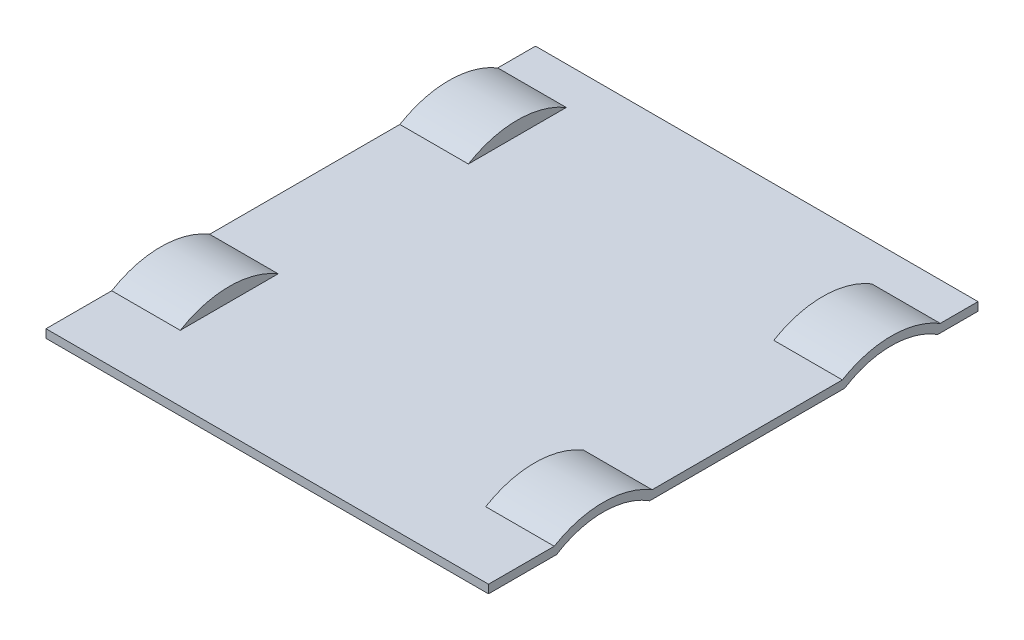
ISO-10303-21;
HEADER;
FILE_DESCRIPTION(('STEP AP214'),'2;1');
FILE_NAME('part.step','',(''),(''),'','','');
FILE_SCHEMA(('AUTOMOTIVE_DESIGN { 1 0 10303 214 1 1 1 1 }'));
ENDSEC;
DATA;
#1=APPLICATION_CONTEXT('core data for automotive mechanical design processes');
#2=APPLICATION_PROTOCOL_DEFINITION('international standard','automotive_design',2000,#1);
#3=PRODUCT_CONTEXT('',#1,'mechanical');
#4=PRODUCT('Part','Part','',(#3));
#5=PRODUCT_RELATED_PRODUCT_CATEGORY('part','',(#4));
#6=PRODUCT_DEFINITION_FORMATION('','',#4);
#7=PRODUCT_DEFINITION_CONTEXT('part definition',#1,'design');
#8=PRODUCT_DEFINITION('design','',#6,#7);
#9=PRODUCT_DEFINITION_SHAPE('','',#8);
#10=(LENGTH_UNIT() NAMED_UNIT(*) SI_UNIT(.MILLI.,.METRE.));
#11=(NAMED_UNIT(*) PLANE_ANGLE_UNIT() SI_UNIT($,.RADIAN.));
#12=(NAMED_UNIT(*) SI_UNIT($,.STERADIAN.) SOLID_ANGLE_UNIT());
#13=UNCERTAINTY_MEASURE_WITH_UNIT(LENGTH_MEASURE(1.E-05),#10,'distance_accuracy_value','');
#14=(GEOMETRIC_REPRESENTATION_CONTEXT(3) GLOBAL_UNCERTAINTY_ASSIGNED_CONTEXT((#13)) GLOBAL_UNIT_ASSIGNED_CONTEXT((#10,
#11,#12)) REPRESENTATION_CONTEXT('',''));
#15=CARTESIAN_POINT('',(0.,0.,0.));
#16=DIRECTION('',(0.,0.,1.));
#17=DIRECTION('',(1.,0.,0.));
#18=AXIS2_PLACEMENT_3D('',#15,#16,#17);
#19=CARTESIAN_POINT('',(-158.2,0.,0.));
#20=DIRECTION('',(0.,-1.,0.));
#21=DIRECTION('',(0.,0.,-1.));
#22=AXIS2_PLACEMENT_3D('',#19,#20,#21);
#23=PLANE('',#22);
#24=DIRECTION('',(0.,0.,-1.));
#25=VECTOR('',#24,1.);
#26=CARTESIAN_POINT('',(-158.2,0.,0.));
#27=LINE('',#26,#25);
#28=CARTESIAN_POINT('',(-158.2,0.,0.));
#29=VERTEX_POINT('',#28);
#30=CARTESIAN_POINT('',(-158.2,0.,-24.3513514061952));
#31=VERTEX_POINT('',#30);
#32=EDGE_CURVE('E183',#29,#31,#27,.T.);
#33=ORIENTED_EDGE('',*,*,#32,.T.);
#34=DIRECTION('',(-1.,0.,0.));
#35=VECTOR('',#34,1.);
#36=CARTESIAN_POINT('',(-136.2,0.,-24.3513514061952));
#37=LINE('',#36,#35);
#38=CARTESIAN_POINT('',(-136.2,0.,-24.3513514061952));
#39=VERTEX_POINT('',#38);
#40=EDGE_CURVE('E57',#39,#31,#37,.T.);
#41=ORIENTED_EDGE('',*,*,#40,.F.);
#42=DIRECTION('',(0.,0.,-1.));
#43=VECTOR('',#42,1.);
#44=CARTESIAN_POINT('',(-136.2,0.,0.));
#45=LINE('',#44,#43);
#46=CARTESIAN_POINT('',(-136.2,0.,-57.6486485938048));
#47=VERTEX_POINT('',#46);
#48=EDGE_CURVE('E175',#39,#47,#45,.T.);
#49=ORIENTED_EDGE('',*,*,#48,.T.);
#50=DIRECTION('',(-1.,0.,0.));
#51=VECTOR('',#50,1.);
#52=CARTESIAN_POINT('',(-136.2,0.,-57.6486485938048));
#53=LINE('',#52,#51);
#54=CARTESIAN_POINT('',(-158.2,0.,-57.6486485938048));
#55=VERTEX_POINT('',#54);
#56=EDGE_CURVE('E172',#47,#55,#53,.T.);
#57=ORIENTED_EDGE('',*,*,#56,.T.);
#58=CARTESIAN_POINT('',(-158.2,0.,-127.351351406195));
#59=VERTEX_POINT('',#58);
#60=EDGE_CURVE('E280',#55,#59,#27,.T.);
#61=ORIENTED_EDGE('',*,*,#60,.T.);
#62=DIRECTION('',(-1.,0.,0.));
#63=VECTOR('',#62,1.);
#64=CARTESIAN_POINT('',(-136.2,0.,-127.351351406195));
#65=LINE('',#64,#63);
#66=CARTESIAN_POINT('',(-136.2,0.,-127.351351406195));
#67=VERTEX_POINT('',#66);
#68=EDGE_CURVE('E49',#67,#59,#65,.T.);
#69=ORIENTED_EDGE('',*,*,#68,.F.);
#70=DIRECTION('',(0.,0.,-1.));
#71=VECTOR('',#70,1.);
#72=CARTESIAN_POINT('',(-136.2,0.,0.));
#73=LINE('',#72,#71);
#74=CARTESIAN_POINT('',(-136.2,0.,-160.648648593805));
#75=VERTEX_POINT('',#74);
#76=EDGE_CURVE('E189',#67,#75,#73,.T.);
#77=ORIENTED_EDGE('',*,*,#76,.T.);
#78=DIRECTION('',(-1.,0.,0.));
#79=VECTOR('',#78,1.);
#80=CARTESIAN_POINT('',(-136.2,0.,-160.648648593805));
#81=LINE('',#80,#79);
#82=CARTESIAN_POINT('',(-158.2,0.,-160.648648593805));
#83=VERTEX_POINT('',#82);
#84=EDGE_CURVE('E196',#75,#83,#81,.T.);
#85=ORIENTED_EDGE('',*,*,#84,.T.);
#86=CARTESIAN_POINT('',(-158.2,0.,-175.));
#87=VERTEX_POINT('',#86);
#88=EDGE_CURVE('E281',#83,#87,#27,.T.);
#89=ORIENTED_EDGE('',*,*,#88,.T.);
#90=DIRECTION('',(1.,0.,0.));
#91=VECTOR('',#90,1.);
#92=CARTESIAN_POINT('',(-158.2,0.,-175.));
#93=LINE('',#92,#91);
#94=CARTESIAN_POINT('',(0.,0.,-175.));
#95=VERTEX_POINT('',#94);
#96=EDGE_CURVE('E36',#87,#95,#93,.T.);
#97=ORIENTED_EDGE('',*,*,#96,.T.);
#98=DIRECTION('',(0.,0.,-1.));
#99=VECTOR('',#98,1.);
#100=CARTESIAN_POINT('',(0.,0.,0.));
#101=LINE('',#100,#99);
#102=CARTESIAN_POINT('',(0.,0.,-160.648648593805));
#103=VERTEX_POINT('',#102);
#104=EDGE_CURVE('E275',#103,#95,#101,.T.);
#105=ORIENTED_EDGE('',*,*,#104,.F.);
#106=DIRECTION('',(1.,0.,0.));
#107=VECTOR('',#106,1.);
#108=CARTESIAN_POINT('',(-22.,0.,-160.648648593805));
#109=LINE('',#108,#107);
#110=CARTESIAN_POINT('',(-22.,0.,-160.648648593805));
#111=VERTEX_POINT('',#110);
#112=EDGE_CURVE('E247',#111,#103,#109,.T.);
#113=ORIENTED_EDGE('',*,*,#112,.F.);
#114=DIRECTION('',(0.,0.,-1.));
#115=VECTOR('',#114,1.);
#116=CARTESIAN_POINT('',(-22.,0.,0.));
#117=LINE('',#116,#115);
#118=CARTESIAN_POINT('',(-22.,0.,-127.351351406195));
#119=VERTEX_POINT('',#118);
#120=EDGE_CURVE('E242',#119,#111,#117,.T.);
#121=ORIENTED_EDGE('',*,*,#120,.F.);
#122=DIRECTION('',(1.,0.,0.));
#123=VECTOR('',#122,1.);
#124=CARTESIAN_POINT('',(-22.,0.,-127.351351406195));
#125=LINE('',#124,#123);
#126=CARTESIAN_POINT('',(0.,0.,-127.351351406195));
#127=VERTEX_POINT('',#126);
#128=EDGE_CURVE('E236',#119,#127,#125,.T.);
#129=ORIENTED_EDGE('',*,*,#128,.T.);
#130=CARTESIAN_POINT('',(0.,0.,-57.6486485938048));
#131=VERTEX_POINT('',#130);
#132=EDGE_CURVE('E295',#131,#127,#101,.T.);
#133=ORIENTED_EDGE('',*,*,#132,.F.);
#134=DIRECTION('',(1.,0.,0.));
#135=VECTOR('',#134,1.);
#136=CARTESIAN_POINT('',(-22.,0.,-57.6486485938048));
#137=LINE('',#136,#135);
#138=CARTESIAN_POINT('',(-22.,0.,-57.6486485938048));
#139=VERTEX_POINT('',#138);
#140=EDGE_CURVE('E234',#139,#131,#137,.T.);
#141=ORIENTED_EDGE('',*,*,#140,.F.);
#142=DIRECTION('',(0.,0.,-1.));
#143=VECTOR('',#142,1.);
#144=CARTESIAN_POINT('',(-22.,0.,0.));
#145=LINE('',#144,#143);
#146=CARTESIAN_POINT('',(-22.,0.,-24.3513514061952));
#147=VERTEX_POINT('',#146);
#148=EDGE_CURVE('E228',#147,#139,#145,.T.);
#149=ORIENTED_EDGE('',*,*,#148,.F.);
#150=DIRECTION('',(1.,0.,0.));
#151=VECTOR('',#150,1.);
#152=CARTESIAN_POINT('',(-22.,0.,-24.3513514061952));
#153=LINE('',#152,#151);
#154=CARTESIAN_POINT('',(0.,0.,-24.3513514061952));
#155=VERTEX_POINT('',#154);
#156=EDGE_CURVE('E237',#147,#155,#153,.T.);
#157=ORIENTED_EDGE('',*,*,#156,.T.);
#158=CARTESIAN_POINT('',(0.,0.,0.));
#159=VERTEX_POINT('',#158);
#160=EDGE_CURVE('E291',#159,#155,#101,.T.);
#161=ORIENTED_EDGE('',*,*,#160,.F.);
#162=DIRECTION('',(1.,0.,0.));
#163=VECTOR('',#162,1.);
#164=CARTESIAN_POINT('',(-158.2,0.,0.));
#165=LINE('',#164,#163);
#166=EDGE_CURVE('E11',#29,#159,#165,.T.);
#167=ORIENTED_EDGE('',*,*,#166,.F.);
#168=EDGE_LOOP('',(#33,#41,#49,#57,#61,#69,#77,#85,#89,#97,#105,#113,#121,#129,#133,#141,#149,
#157,#161,#167));
#169=FACE_BOUND('',#168,.T.);
#170=ADVANCED_FACE('F33',(#169),#23,.T.);
#171=CARTESIAN_POINT('',(-158.2,2.99999999999998,0.));
#172=DIRECTION('',(0.,1.,0.));
#173=DIRECTION('',(0.,0.,1.));
#174=AXIS2_PLACEMENT_3D('',#171,#172,#173);
#175=PLANE('',#174);
#176=DIRECTION('',(0.,0.,1.));
#177=VECTOR('',#176,1.);
#178=CARTESIAN_POINT('',(-158.2,2.99999999999998,0.));
#179=LINE('',#178,#177);
#180=CARTESIAN_POINT('',(-158.2,3.,-175.));
#181=VERTEX_POINT('',#180);
#182=CARTESIAN_POINT('',(-158.2,3.,-161.500785696648));
#183=VERTEX_POINT('',#182);
#184=EDGE_CURVE('E285',#181,#183,#179,.T.);
#185=ORIENTED_EDGE('',*,*,#184,.T.);
#186=DIRECTION('',(-1.,0.,0.));
#187=VECTOR('',#186,1.);
#188=CARTESIAN_POINT('',(-133.7,3.,-161.500785696648));
#189=LINE('',#188,#187);
#190=CARTESIAN_POINT('',(-133.7,3.,-161.500785696648));
#191=VERTEX_POINT('',#190);
#192=EDGE_CURVE('E208',#191,#183,#189,.T.);
#193=ORIENTED_EDGE('',*,*,#192,.F.);
#194=DIRECTION('',(0.,0.,1.));
#195=VECTOR('',#194,1.);
#196=CARTESIAN_POINT('',(-133.7,2.99999999999998,0.));
#197=LINE('',#196,#195);
#198=CARTESIAN_POINT('',(-133.7,2.99999999999999,-126.499214303352));
#199=VERTEX_POINT('',#198);
#200=EDGE_CURVE('E200',#191,#199,#197,.T.);
#201=ORIENTED_EDGE('',*,*,#200,.T.);
#202=DIRECTION('',(-1.,0.,0.));
#203=VECTOR('',#202,1.);
#204=CARTESIAN_POINT('',(-133.7,2.99999999999999,-126.499214303352));
#205=LINE('',#204,#203);
#206=CARTESIAN_POINT('',(-158.2,2.99999999999999,-126.499214303352));
#207=VERTEX_POINT('',#206);
#208=EDGE_CURVE('E205',#199,#207,#205,.T.);
#209=ORIENTED_EDGE('',*,*,#208,.T.);
#210=CARTESIAN_POINT('',(-158.2,2.99999999999998,-58.5007856966481));
#211=VERTEX_POINT('',#210);
#212=EDGE_CURVE('E288',#207,#211,#179,.T.);
#213=ORIENTED_EDGE('',*,*,#212,.T.);
#214=DIRECTION('',(-1.,0.,0.));
#215=VECTOR('',#214,1.);
#216=CARTESIAN_POINT('',(-133.7,2.99999999999998,-58.5007856966481));
#217=LINE('',#216,#215);
#218=CARTESIAN_POINT('',(-133.7,2.99999999999999,-58.5007856966481));
#219=VERTEX_POINT('',#218);
#220=EDGE_CURVE('E222',#219,#211,#217,.T.);
#221=ORIENTED_EDGE('',*,*,#220,.F.);
#222=DIRECTION('',(0.,0.,1.));
#223=VECTOR('',#222,1.);
#224=CARTESIAN_POINT('',(-133.7,2.99999999999998,0.));
#225=LINE('',#224,#223);
#226=CARTESIAN_POINT('',(-133.7,2.99999999999998,-23.4992143033519));
#227=VERTEX_POINT('',#226);
#228=EDGE_CURVE('E214',#219,#227,#225,.T.);
#229=ORIENTED_EDGE('',*,*,#228,.T.);
#230=DIRECTION('',(-1.,0.,0.));
#231=VECTOR('',#230,1.);
#232=CARTESIAN_POINT('',(-133.7,2.99999999999998,-23.4992143033519));
#233=LINE('',#232,#231);
#234=CARTESIAN_POINT('',(-158.2,2.99999999999998,-23.4992143033519));
#235=VERTEX_POINT('',#234);
#236=EDGE_CURVE('E219',#227,#235,#233,.T.);
#237=ORIENTED_EDGE('',*,*,#236,.T.);
#238=CARTESIAN_POINT('',(-158.2,2.99999999999998,0.));
#239=VERTEX_POINT('',#238);
#240=EDGE_CURVE('E284',#235,#239,#179,.T.);
#241=ORIENTED_EDGE('',*,*,#240,.T.);
#242=DIRECTION('',(1.,0.,0.));
#243=VECTOR('',#242,1.);
#244=CARTESIAN_POINT('',(-158.2,2.99999999999998,0.));
#245=LINE('',#244,#243);
#246=CARTESIAN_POINT('',(0.,2.99999999999998,0.));
#247=VERTEX_POINT('',#246);
#248=EDGE_CURVE('E41',#239,#247,#245,.T.);
#249=ORIENTED_EDGE('',*,*,#248,.T.);
#250=DIRECTION('',(0.,0.,1.));
#251=VECTOR('',#250,1.);
#252=CARTESIAN_POINT('',(0.,2.99999999999998,0.));
#253=LINE('',#252,#251);
#254=CARTESIAN_POINT('',(0.,2.99999999999998,-23.4992143033519));
#255=VERTEX_POINT('',#254);
#256=EDGE_CURVE('E298',#255,#247,#253,.T.);
#257=ORIENTED_EDGE('',*,*,#256,.F.);
#258=DIRECTION('',(1.,0.,0.));
#259=VECTOR('',#258,1.);
#260=CARTESIAN_POINT('',(-24.5,2.99999999999998,-23.4992143033519));
#261=LINE('',#260,#259);
#262=CARTESIAN_POINT('',(-24.5,2.99999999999998,-23.4992143033519));
#263=VERTEX_POINT('',#262);
#264=EDGE_CURVE('E272',#263,#255,#261,.T.);
#265=ORIENTED_EDGE('',*,*,#264,.F.);
#266=DIRECTION('',(0.,0.,1.));
#267=VECTOR('',#266,1.);
#268=CARTESIAN_POINT('',(-24.5,2.99999999999998,0.));
#269=LINE('',#268,#267);
#270=CARTESIAN_POINT('',(-24.5,2.99999999999998,-58.5007856966481));
#271=VERTEX_POINT('',#270);
#272=EDGE_CURVE('E265',#271,#263,#269,.T.);
#273=ORIENTED_EDGE('',*,*,#272,.F.);
#274=DIRECTION('',(1.,0.,0.));
#275=VECTOR('',#274,1.);
#276=CARTESIAN_POINT('',(-24.5,2.99999999999998,-58.5007856966481));
#277=LINE('',#276,#275);
#278=CARTESIAN_POINT('',(0.,2.99999999999998,-58.5007856966481));
#279=VERTEX_POINT('',#278);
#280=EDGE_CURVE('E270',#271,#279,#277,.T.);
#281=ORIENTED_EDGE('',*,*,#280,.T.);
#282=CARTESIAN_POINT('',(0.,2.99999999999999,-126.499214303352));
#283=VERTEX_POINT('',#282);
#284=EDGE_CURVE('E303',#283,#279,#253,.T.);
#285=ORIENTED_EDGE('',*,*,#284,.F.);
#286=DIRECTION('',(1.,0.,0.));
#287=VECTOR('',#286,1.);
#288=CARTESIAN_POINT('',(-24.5,2.99999999999999,-126.499214303352));
#289=LINE('',#288,#287);
#290=CARTESIAN_POINT('',(-24.5,2.99999999999999,-126.499214303352));
#291=VERTEX_POINT('',#290);
#292=EDGE_CURVE('E259',#291,#283,#289,.T.);
#293=ORIENTED_EDGE('',*,*,#292,.F.);
#294=DIRECTION('',(0.,0.,1.));
#295=VECTOR('',#294,1.);
#296=CARTESIAN_POINT('',(-24.5,2.99999999999998,0.));
#297=LINE('',#296,#295);
#298=CARTESIAN_POINT('',(-24.5,3.,-161.500785696648));
#299=VERTEX_POINT('',#298);
#300=EDGE_CURVE('E252',#299,#291,#297,.T.);
#301=ORIENTED_EDGE('',*,*,#300,.F.);
#302=DIRECTION('',(1.,0.,0.));
#303=VECTOR('',#302,1.);
#304=CARTESIAN_POINT('',(-24.5,3.,-161.500785696648));
#305=LINE('',#304,#303);
#306=CARTESIAN_POINT('',(0.,3.,-161.500785696648));
#307=VERTEX_POINT('',#306);
#308=EDGE_CURVE('E257',#299,#307,#305,.T.);
#309=ORIENTED_EDGE('',*,*,#308,.T.);
#310=CARTESIAN_POINT('',(0.,3.,-175.));
#311=VERTEX_POINT('',#310);
#312=EDGE_CURVE('E299',#311,#307,#253,.T.);
#313=ORIENTED_EDGE('',*,*,#312,.F.);
#314=DIRECTION('',(1.,0.,0.));
#315=VECTOR('',#314,1.);
#316=CARTESIAN_POINT('',(-158.2,3.,-175.));
#317=LINE('',#316,#315);
#318=EDGE_CURVE('E307',#181,#311,#317,.T.);
#319=ORIENTED_EDGE('',*,*,#318,.F.);
#320=EDGE_LOOP('',(#185,#193,#201,#209,#213,#221,#229,#237,#241,#249,#257,#265,#273,#281,#285,
#293,#301,#309,#313,#319));
#321=FACE_BOUND('',#320,.T.);
#322=ADVANCED_FACE('F345',(#321),#175,.T.);
#323=CARTESIAN_POINT('',(-158.2,0.,0.));
#324=DIRECTION('',(0.,0.,1.));
#325=DIRECTION('',(0.,-1.,0.));
#326=AXIS2_PLACEMENT_3D('',#323,#324,#325);
#327=PLANE('',#326);
#328=DIRECTION('',(0.,-1.,0.));
#329=VECTOR('',#328,1.);
#330=CARTESIAN_POINT('',(0.,0.,0.));
#331=LINE('',#330,#329);
#332=EDGE_CURVE('E302',#247,#159,#331,.T.);
#333=ORIENTED_EDGE('',*,*,#332,.F.);
#334=ORIENTED_EDGE('',*,*,#248,.F.);
#335=DIRECTION('',(0.,-1.,0.));
#336=VECTOR('',#335,1.);
#337=CARTESIAN_POINT('',(-158.2,0.,0.));
#338=LINE('',#337,#336);
#339=EDGE_CURVE('E287',#239,#29,#338,.T.);
#340=ORIENTED_EDGE('',*,*,#339,.T.);
#341=ORIENTED_EDGE('',*,*,#166,.T.);
#342=EDGE_LOOP('',(#333,#334,#340,#341));
#343=FACE_BOUND('',#342,.T.);
#344=ADVANCED_FACE('F349',(#343),#327,.T.);
#345=CARTESIAN_POINT('',(-158.2,0.,-175.));
#346=DIRECTION('',(0.,0.,-1.));
#347=DIRECTION('',(-1.,0.,0.));
#348=AXIS2_PLACEMENT_3D('',#345,#346,#347);
#349=PLANE('',#348);
#350=DIRECTION('',(0.,1.,0.));
#351=VECTOR('',#350,1.);
#352=CARTESIAN_POINT('',(0.,0.,-175.));
#353=LINE('',#352,#351);
#354=EDGE_CURVE('E294',#95,#311,#353,.T.);
#355=ORIENTED_EDGE('',*,*,#354,.F.);
#356=ORIENTED_EDGE('',*,*,#96,.F.);
#357=DIRECTION('',(0.,1.,0.));
#358=VECTOR('',#357,1.);
#359=CARTESIAN_POINT('',(-158.2,0.,-175.));
#360=LINE('',#359,#358);
#361=EDGE_CURVE('E279',#87,#181,#360,.T.);
#362=ORIENTED_EDGE('',*,*,#361,.T.);
#363=ORIENTED_EDGE('',*,*,#318,.T.);
#364=EDGE_LOOP('',(#355,#356,#362,#363));
#365=FACE_BOUND('',#364,.T.);
#366=ADVANCED_FACE('F317',(#365),#349,.T.);
#367=CARTESIAN_POINT('',(-158.2,0.,0.));
#368=DIRECTION('',(1.,0.,0.));
#369=DIRECTION('',(0.,0.,-1.));
#370=AXIS2_PLACEMENT_3D('',#367,#368,#369);
#371=PLANE('',#370);
#372=CARTESIAN_POINT('',(-158.2,-26.15,-41.));
#373=DIRECTION('',(1.,0.,0.));
#374=DIRECTION('',(0.,0.,-1.));
#375=AXIS2_PLACEMENT_3D('',#372,#373,#374);
#376=CIRCLE('',#375,31.);
#377=EDGE_CURVE('E179',#55,#31,#376,.T.);
#378=ORIENTED_EDGE('',*,*,#377,.T.);
#379=ORIENTED_EDGE('',*,*,#32,.F.);
#380=ORIENTED_EDGE('',*,*,#339,.F.);
#381=ORIENTED_EDGE('',*,*,#240,.F.);
#382=CARTESIAN_POINT('',(-158.2,-26.15,-41.));
#383=DIRECTION('',(1.,0.,0.));
#384=DIRECTION('',(0.,0.,-1.));
#385=AXIS2_PLACEMENT_3D('',#382,#383,#384);
#386=CIRCLE('',#385,34.);
#387=EDGE_CURVE('E211',#211,#235,#386,.T.);
#388=ORIENTED_EDGE('',*,*,#387,.F.);
#389=ORIENTED_EDGE('',*,*,#212,.F.);
#390=CARTESIAN_POINT('',(-158.2,-26.15,-144.));
#391=DIRECTION('',(1.,0.,0.));
#392=DIRECTION('',(0.,0.,-1.));
#393=AXIS2_PLACEMENT_3D('',#390,#391,#392);
#394=CIRCLE('',#393,34.);
#395=EDGE_CURVE('E185',#183,#207,#394,.T.);
#396=ORIENTED_EDGE('',*,*,#395,.F.);
#397=ORIENTED_EDGE('',*,*,#184,.F.);
#398=ORIENTED_EDGE('',*,*,#361,.F.);
#399=ORIENTED_EDGE('',*,*,#88,.F.);
#400=CARTESIAN_POINT('',(-158.2,-26.15,-144.));
#401=DIRECTION('',(1.,0.,0.));
#402=DIRECTION('',(0.,0.,-1.));
#403=AXIS2_PLACEMENT_3D('',#400,#401,#402);
#404=CIRCLE('',#403,31.);
#405=EDGE_CURVE('E193',#83,#59,#404,.T.);
#406=ORIENTED_EDGE('',*,*,#405,.T.);
#407=ORIENTED_EDGE('',*,*,#60,.F.);
#408=EDGE_LOOP('',(#378,#379,#380,#381,#388,#389,#396,#397,#398,#399,#406,#407));
#409=FACE_BOUND('',#408,.T.);
#410=ADVANCED_FACE('F359',(#409),#371,.F.);
#411=CARTESIAN_POINT('',(0.,0.,0.));
#412=DIRECTION('',(1.,0.,0.));
#413=DIRECTION('',(0.,0.,-1.));
#414=AXIS2_PLACEMENT_3D('',#411,#412,#413);
#415=PLANE('',#414);
#416=CARTESIAN_POINT('',(0.,-26.15,-41.));
#417=DIRECTION('',(1.,0.,0.));
#418=DIRECTION('',(0.,0.,-1.));
#419=AXIS2_PLACEMENT_3D('',#416,#417,#418);
#420=CIRCLE('',#419,31.);
#421=EDGE_CURVE('E231',#131,#155,#420,.T.);
#422=ORIENTED_EDGE('',*,*,#421,.F.);
#423=ORIENTED_EDGE('',*,*,#132,.T.);
#424=CARTESIAN_POINT('',(0.,-26.15,-144.));
#425=DIRECTION('',(1.,0.,0.));
#426=DIRECTION('',(0.,0.,-1.));
#427=AXIS2_PLACEMENT_3D('',#424,#425,#426);
#428=CIRCLE('',#427,31.);
#429=EDGE_CURVE('E225',#103,#127,#428,.T.);
#430=ORIENTED_EDGE('',*,*,#429,.F.);
#431=ORIENTED_EDGE('',*,*,#104,.T.);
#432=ORIENTED_EDGE('',*,*,#354,.T.);
#433=ORIENTED_EDGE('',*,*,#312,.T.);
#434=CARTESIAN_POINT('',(0.,-26.15,-144.));
#435=DIRECTION('',(1.,0.,0.));
#436=DIRECTION('',(0.,0.,-1.));
#437=AXIS2_PLACEMENT_3D('',#434,#435,#436);
#438=CIRCLE('',#437,34.);
#439=EDGE_CURVE('E240',#307,#283,#438,.T.);
#440=ORIENTED_EDGE('',*,*,#439,.T.);
#441=ORIENTED_EDGE('',*,*,#284,.T.);
#442=CARTESIAN_POINT('',(0.,-26.15,-41.));
#443=DIRECTION('',(1.,0.,0.));
#444=DIRECTION('',(0.,0.,-1.));
#445=AXIS2_PLACEMENT_3D('',#442,#443,#444);
#446=CIRCLE('',#445,34.);
#447=EDGE_CURVE('E262',#279,#255,#446,.T.);
#448=ORIENTED_EDGE('',*,*,#447,.T.);
#449=ORIENTED_EDGE('',*,*,#256,.T.);
#450=ORIENTED_EDGE('',*,*,#332,.T.);
#451=ORIENTED_EDGE('',*,*,#160,.T.);
#452=EDGE_LOOP('',(#422,#423,#430,#431,#432,#433,#440,#441,#448,#449,#450,#451));
#453=FACE_BOUND('',#452,.T.);
#454=ADVANCED_FACE('F320',(#453),#415,.T.);
#455=CARTESIAN_POINT('',(-24.5,-26.15,-41.));
#456=DIRECTION('',(1.,0.,0.));
#457=DIRECTION('',(0.,0.,-1.));
#458=AXIS2_PLACEMENT_3D('',#455,#456,#457);
#459=CYLINDRICAL_SURFACE('',#458,34.);
#460=ORIENTED_EDGE('',*,*,#447,.F.);
#461=ORIENTED_EDGE('',*,*,#280,.F.);
#462=CARTESIAN_POINT('',(-24.5,-26.15,-41.));
#463=DIRECTION('',(1.,0.,0.));
#464=DIRECTION('',(0.,0.,-1.));
#465=AXIS2_PLACEMENT_3D('',#462,#463,#464);
#466=CIRCLE('',#465,34.);
#467=EDGE_CURVE('E267',#271,#263,#466,.T.);
#468=ORIENTED_EDGE('',*,*,#467,.T.);
#469=ORIENTED_EDGE('',*,*,#264,.T.);
#470=EDGE_LOOP('',(#460,#461,#468,#469));
#471=FACE_BOUND('',#470,.T.);
#472=ADVANCED_FACE('F368',(#471),#459,.T.);
#473=CARTESIAN_POINT('',(-24.5,0.,0.));
#474=DIRECTION('',(1.,0.,0.));
#475=DIRECTION('',(0.,0.,-1.));
#476=AXIS2_PLACEMENT_3D('',#473,#474,#475);
#477=PLANE('',#476);
#478=ORIENTED_EDGE('',*,*,#272,.T.);
#479=ORIENTED_EDGE('',*,*,#467,.F.);
#480=EDGE_LOOP('',(#478,#479));
#481=FACE_BOUND('',#480,.T.);
#482=ADVANCED_FACE('F372',(#481),#477,.F.);
#483=CARTESIAN_POINT('',(-24.5,-26.15,-144.));
#484=DIRECTION('',(1.,0.,0.));
#485=DIRECTION('',(0.,0.,-1.));
#486=AXIS2_PLACEMENT_3D('',#483,#484,#485);
#487=CYLINDRICAL_SURFACE('',#486,34.);
#488=ORIENTED_EDGE('',*,*,#439,.F.);
#489=ORIENTED_EDGE('',*,*,#308,.F.);
#490=CARTESIAN_POINT('',(-24.5,-26.15,-144.));
#491=DIRECTION('',(1.,0.,0.));
#492=DIRECTION('',(0.,0.,-1.));
#493=AXIS2_PLACEMENT_3D('',#490,#491,#492);
#494=CIRCLE('',#493,34.);
#495=EDGE_CURVE('E254',#299,#291,#494,.T.);
#496=ORIENTED_EDGE('',*,*,#495,.T.);
#497=ORIENTED_EDGE('',*,*,#292,.T.);
#498=EDGE_LOOP('',(#488,#489,#496,#497));
#499=FACE_BOUND('',#498,.T.);
#500=ADVANCED_FACE('F376',(#499),#487,.T.);
#501=CARTESIAN_POINT('',(-24.5,0.,0.));
#502=DIRECTION('',(1.,0.,0.));
#503=DIRECTION('',(0.,0.,-1.));
#504=AXIS2_PLACEMENT_3D('',#501,#502,#503);
#505=PLANE('',#504);
#506=ORIENTED_EDGE('',*,*,#300,.T.);
#507=ORIENTED_EDGE('',*,*,#495,.F.);
#508=EDGE_LOOP('',(#506,#507));
#509=FACE_BOUND('',#508,.T.);
#510=ADVANCED_FACE('F342',(#509),#505,.F.);
#511=CARTESIAN_POINT('',(-22.,-26.15,-144.));
#512=DIRECTION('',(1.,0.,0.));
#513=DIRECTION('',(0.,0.,-1.));
#514=AXIS2_PLACEMENT_3D('',#511,#512,#513);
#515=CYLINDRICAL_SURFACE('',#514,31.);
#516=ORIENTED_EDGE('',*,*,#429,.T.);
#517=ORIENTED_EDGE('',*,*,#128,.F.);
#518=CARTESIAN_POINT('',(-22.,-26.15,-144.));
#519=DIRECTION('',(1.,0.,0.));
#520=DIRECTION('',(0.,0.,-1.));
#521=AXIS2_PLACEMENT_3D('',#518,#519,#520);
#522=CIRCLE('',#521,31.);
#523=EDGE_CURVE('E244',#111,#119,#522,.T.);
#524=ORIENTED_EDGE('',*,*,#523,.F.);
#525=ORIENTED_EDGE('',*,*,#112,.T.);
#526=EDGE_LOOP('',(#516,#517,#524,#525));
#527=FACE_BOUND('',#526,.T.);
#528=ADVANCED_FACE('F329',(#527),#515,.F.);
#529=CARTESIAN_POINT('',(-22.,0.,0.));
#530=DIRECTION('',(1.,0.,0.));
#531=DIRECTION('',(0.,0.,-1.));
#532=AXIS2_PLACEMENT_3D('',#529,#530,#531);
#533=PLANE('',#532);
#534=ORIENTED_EDGE('',*,*,#120,.T.);
#535=ORIENTED_EDGE('',*,*,#523,.T.);
#536=EDGE_LOOP('',(#534,#535));
#537=FACE_BOUND('',#536,.T.);
#538=ADVANCED_FACE('F331',(#537),#533,.T.);
#539=CARTESIAN_POINT('',(-22.,-26.15,-41.));
#540=DIRECTION('',(1.,0.,0.));
#541=DIRECTION('',(0.,0.,-1.));
#542=AXIS2_PLACEMENT_3D('',#539,#540,#541);
#543=CYLINDRICAL_SURFACE('',#542,31.);
#544=ORIENTED_EDGE('',*,*,#421,.T.);
#545=ORIENTED_EDGE('',*,*,#156,.F.);
#546=CARTESIAN_POINT('',(-22.,-26.15,-41.));
#547=DIRECTION('',(1.,0.,0.));
#548=DIRECTION('',(0.,0.,-1.));
#549=AXIS2_PLACEMENT_3D('',#546,#547,#548);
#550=CIRCLE('',#549,31.);
#551=EDGE_CURVE('E230',#139,#147,#550,.T.);
#552=ORIENTED_EDGE('',*,*,#551,.F.);
#553=ORIENTED_EDGE('',*,*,#140,.T.);
#554=EDGE_LOOP('',(#544,#545,#552,#553));
#555=FACE_BOUND('',#554,.T.);
#556=ADVANCED_FACE('F333',(#555),#543,.F.);
#557=CARTESIAN_POINT('',(-22.,0.,0.));
#558=DIRECTION('',(1.,0.,0.));
#559=DIRECTION('',(0.,0.,-1.));
#560=AXIS2_PLACEMENT_3D('',#557,#558,#559);
#561=PLANE('',#560);
#562=ORIENTED_EDGE('',*,*,#148,.T.);
#563=ORIENTED_EDGE('',*,*,#551,.T.);
#564=EDGE_LOOP('',(#562,#563));
#565=FACE_BOUND('',#564,.T.);
#566=ADVANCED_FACE('F339',(#565),#561,.T.);
#567=CARTESIAN_POINT('',(-133.7,-26.15,-41.));
#568=DIRECTION('',(-1.,0.,0.));
#569=DIRECTION('',(0.,0.,1.));
#570=AXIS2_PLACEMENT_3D('',#567,#568,#569);
#571=CYLINDRICAL_SURFACE('',#570,34.);
#572=ORIENTED_EDGE('',*,*,#387,.T.);
#573=ORIENTED_EDGE('',*,*,#236,.F.);
#574=CARTESIAN_POINT('',(-133.7,-26.15,-41.));
#575=DIRECTION('',(1.,0.,0.));
#576=DIRECTION('',(0.,0.,-1.));
#577=AXIS2_PLACEMENT_3D('',#574,#575,#576);
#578=CIRCLE('',#577,34.);
#579=EDGE_CURVE('E216',#219,#227,#578,.T.);
#580=ORIENTED_EDGE('',*,*,#579,.F.);
#581=ORIENTED_EDGE('',*,*,#220,.T.);
#582=EDGE_LOOP('',(#572,#573,#580,#581));
#583=FACE_BOUND('',#582,.T.);
#584=ADVANCED_FACE('F400',(#583),#571,.T.);
#585=CARTESIAN_POINT('',(-133.7,0.,0.));
#586=DIRECTION('',(-1.,0.,0.));
#587=DIRECTION('',(0.,0.,-1.));
#588=AXIS2_PLACEMENT_3D('',#585,#586,#587);
#589=PLANE('',#588);
#590=ORIENTED_EDGE('',*,*,#228,.F.);
#591=ORIENTED_EDGE('',*,*,#579,.T.);
#592=EDGE_LOOP('',(#590,#591));
#593=FACE_BOUND('',#592,.T.);
#594=ADVANCED_FACE('F405',(#593),#589,.F.);
#595=CARTESIAN_POINT('',(-133.7,-26.15,-144.));
#596=DIRECTION('',(-1.,0.,0.));
#597=DIRECTION('',(0.,0.,1.));
#598=AXIS2_PLACEMENT_3D('',#595,#596,#597);
#599=CYLINDRICAL_SURFACE('',#598,34.);
#600=ORIENTED_EDGE('',*,*,#395,.T.);
#601=ORIENTED_EDGE('',*,*,#208,.F.);
#602=CARTESIAN_POINT('',(-133.7,-26.15,-144.));
#603=DIRECTION('',(1.,0.,0.));
#604=DIRECTION('',(0.,0.,-1.));
#605=AXIS2_PLACEMENT_3D('',#602,#603,#604);
#606=CIRCLE('',#605,34.);
#607=EDGE_CURVE('E202',#191,#199,#606,.T.);
#608=ORIENTED_EDGE('',*,*,#607,.F.);
#609=ORIENTED_EDGE('',*,*,#192,.T.);
#610=EDGE_LOOP('',(#600,#601,#608,#609));
#611=FACE_BOUND('',#610,.T.);
#612=ADVANCED_FACE('F411',(#611),#599,.T.);
#613=CARTESIAN_POINT('',(-133.7,0.,0.));
#614=DIRECTION('',(-1.,0.,0.));
#615=DIRECTION('',(0.,0.,-1.));
#616=AXIS2_PLACEMENT_3D('',#613,#614,#615);
#617=PLANE('',#616);
#618=ORIENTED_EDGE('',*,*,#200,.F.);
#619=ORIENTED_EDGE('',*,*,#607,.T.);
#620=EDGE_LOOP('',(#618,#619));
#621=FACE_BOUND('',#620,.T.);
#622=ADVANCED_FACE('F415',(#621),#617,.F.);
#623=CARTESIAN_POINT('',(-136.2,-26.15,-144.));
#624=DIRECTION('',(-1.,0.,0.));
#625=DIRECTION('',(0.,0.,1.));
#626=AXIS2_PLACEMENT_3D('',#623,#624,#625);
#627=CYLINDRICAL_SURFACE('',#626,31.);
#628=ORIENTED_EDGE('',*,*,#405,.F.);
#629=ORIENTED_EDGE('',*,*,#84,.F.);
#630=CARTESIAN_POINT('',(-136.2,-26.15,-144.));
#631=DIRECTION('',(1.,0.,0.));
#632=DIRECTION('',(0.,0.,-1.));
#633=AXIS2_PLACEMENT_3D('',#630,#631,#632);
#634=CIRCLE('',#633,31.);
#635=EDGE_CURVE('E192',#75,#67,#634,.T.);
#636=ORIENTED_EDGE('',*,*,#635,.T.);
#637=ORIENTED_EDGE('',*,*,#68,.T.);
#638=EDGE_LOOP('',(#628,#629,#636,#637));
#639=FACE_BOUND('',#638,.T.);
#640=ADVANCED_FACE('F419',(#639),#627,.F.);
#641=CARTESIAN_POINT('',(-136.2,0.,0.));
#642=DIRECTION('',(-1.,0.,0.));
#643=DIRECTION('',(0.,0.,-1.));
#644=AXIS2_PLACEMENT_3D('',#641,#642,#643);
#645=PLANE('',#644);
#646=ORIENTED_EDGE('',*,*,#76,.F.);
#647=ORIENTED_EDGE('',*,*,#635,.F.);
#648=EDGE_LOOP('',(#646,#647));
#649=FACE_BOUND('',#648,.T.);
#650=ADVANCED_FACE('F423',(#649),#645,.T.);
#651=CARTESIAN_POINT('',(-136.2,-26.15,-41.));
#652=DIRECTION('',(-1.,0.,0.));
#653=DIRECTION('',(0.,0.,1.));
#654=AXIS2_PLACEMENT_3D('',#651,#652,#653);
#655=CYLINDRICAL_SURFACE('',#654,31.);
#656=ORIENTED_EDGE('',*,*,#377,.F.);
#657=ORIENTED_EDGE('',*,*,#56,.F.);
#658=CARTESIAN_POINT('',(-136.2,-26.15,-41.));
#659=DIRECTION('',(1.,0.,0.));
#660=DIRECTION('',(0.,0.,-1.));
#661=AXIS2_PLACEMENT_3D('',#658,#659,#660);
#662=CIRCLE('',#661,31.);
#663=EDGE_CURVE('E168',#47,#39,#662,.T.);
#664=ORIENTED_EDGE('',*,*,#663,.T.);
#665=ORIENTED_EDGE('',*,*,#40,.T.);
#666=EDGE_LOOP('',(#656,#657,#664,#665));
#667=FACE_BOUND('',#666,.T.);
#668=ADVANCED_FACE('F170',(#667),#655,.F.);
#669=CARTESIAN_POINT('',(-136.2,0.,0.));
#670=DIRECTION('',(-1.,0.,0.));
#671=DIRECTION('',(0.,0.,-1.));
#672=AXIS2_PLACEMENT_3D('',#669,#670,#671);
#673=PLANE('',#672);
#674=ORIENTED_EDGE('',*,*,#48,.F.);
#675=ORIENTED_EDGE('',*,*,#663,.F.);
#676=EDGE_LOOP('',(#674,#675));
#677=FACE_BOUND('',#676,.T.);
#678=ADVANCED_FACE('F177',(#677),#673,.T.);
#679=CLOSED_SHELL('',(#170,#322,#344,#366,#410,#454,#472,#482,#500,#510,#528,#538,#556,#566,
#584,#594,#612,#622,#640,#650,#668,#678));
#680=MANIFOLD_SOLID_BREP('B2',#679);
#681=ADVANCED_BREP_SHAPE_REPRESENTATION('',(#18,#680),#14);
#682=SHAPE_DEFINITION_REPRESENTATION(#9,#681);
ENDSEC;
END-ISO-10303-21;
